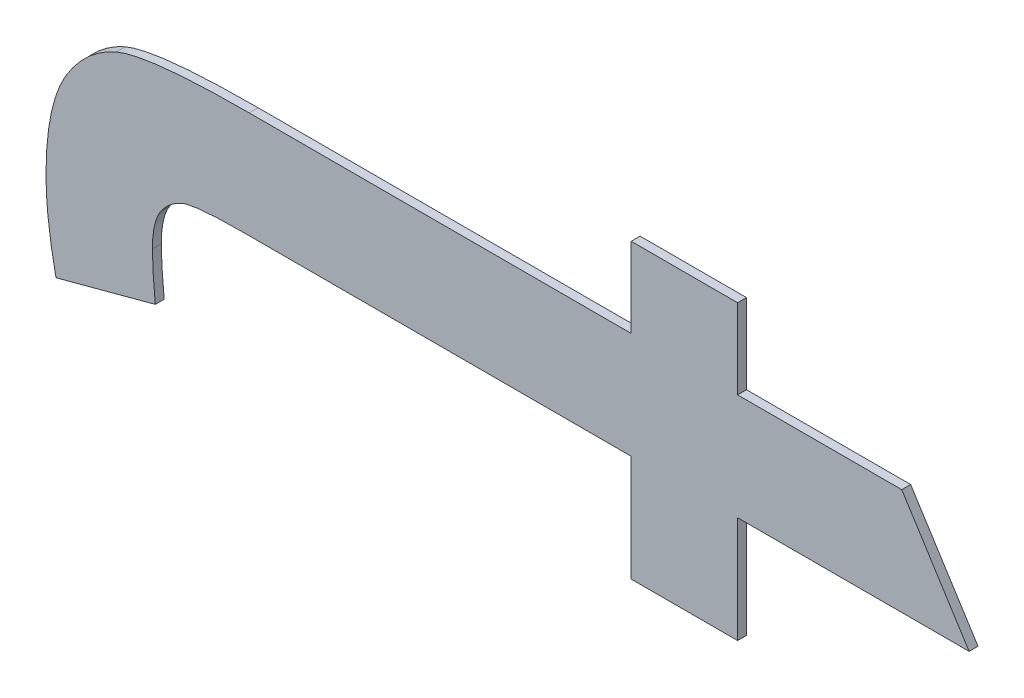
ISO-10303-21;
HEADER;
FILE_DESCRIPTION(('STEP AP214'),'2;1');
FILE_NAME('part.step','',(''),(''),'','','');
FILE_SCHEMA(('AUTOMOTIVE_DESIGN { 1 0 10303 214 1 1 1 1 }'));
ENDSEC;
DATA;
#1=APPLICATION_CONTEXT('core data for automotive mechanical design processes');
#2=APPLICATION_PROTOCOL_DEFINITION('international standard','automotive_design',2000,#1);
#3=PRODUCT_CONTEXT('',#1,'mechanical');
#4=PRODUCT('Part','Part','',(#3));
#5=PRODUCT_RELATED_PRODUCT_CATEGORY('part','',(#4));
#6=PRODUCT_DEFINITION_FORMATION('','',#4);
#7=PRODUCT_DEFINITION_CONTEXT('part definition',#1,'design');
#8=PRODUCT_DEFINITION('design','',#6,#7);
#9=PRODUCT_DEFINITION_SHAPE('','',#8);
#10=(LENGTH_UNIT() NAMED_UNIT(*) SI_UNIT(.MILLI.,.METRE.));
#11=(NAMED_UNIT(*) PLANE_ANGLE_UNIT() SI_UNIT($,.RADIAN.));
#12=(NAMED_UNIT(*) SI_UNIT($,.STERADIAN.) SOLID_ANGLE_UNIT());
#13=UNCERTAINTY_MEASURE_WITH_UNIT(LENGTH_MEASURE(1.E-05),#10,'distance_accuracy_value','');
#14=(GEOMETRIC_REPRESENTATION_CONTEXT(3) GLOBAL_UNCERTAINTY_ASSIGNED_CONTEXT((#13)) GLOBAL_UNIT_ASSIGNED_CONTEXT((#10,
#11,#12)) REPRESENTATION_CONTEXT('',''));
#15=CARTESIAN_POINT('',(0.,0.,0.));
#16=DIRECTION('',(0.,0.,1.));
#17=DIRECTION('',(1.,0.,0.));
#18=AXIS2_PLACEMENT_3D('',#15,#16,#17);
#19=CARTESIAN_POINT('',(1.0877452835503,1.3267694172606,1.7496000059366));
#20=DIRECTION('',(0.258668742971966,-0.965966087090692,0.));
#21=DIRECTION('',(0.,0.,-1.));
#22=AXIS2_PLACEMENT_3D('',#19,#20,#21);
#23=PLANE('',#22);
#24=DIRECTION('',(0.,0.,1.));
#25=VECTOR('',#24,1.);
#26=CARTESIAN_POINT('',(1.0899779799409,1.3273672941183,1.7492000059366));
#27=LINE('',#26,#25);
#28=CARTESIAN_POINT('',(1.0899779799409,1.3273672941183,1.7492000059366));
#29=VERTEX_POINT('',#28);
#30=CARTESIAN_POINT('',(1.0899779799409,1.3273672941183,1.7496000059366));
#31=VERTEX_POINT('',#30);
#32=EDGE_CURVE('E11',#29,#31,#27,.T.);
#33=ORIENTED_EDGE('',*,*,#32,.T.);
#34=DIRECTION('',(-0.965966087090692,-0.258668742971966,0.));
#35=VECTOR('',#34,1.);
#36=CARTESIAN_POINT('',(1.0899779799409,1.3273672941183,1.7496000059366));
#37=LINE('',#36,#35);
#38=CARTESIAN_POINT('',(1.0855125871597,1.3261715404029,1.7496000059366));
#39=VERTEX_POINT('',#38);
#40=EDGE_CURVE('E24',#31,#39,#37,.T.);
#41=ORIENTED_EDGE('',*,*,#40,.T.);
#42=DIRECTION('',(0.,0.,1.));
#43=VECTOR('',#42,1.);
#44=CARTESIAN_POINT('',(1.0855125871597,1.3261715404029,1.7492000059366));
#45=LINE('',#44,#43);
#46=CARTESIAN_POINT('',(1.0855125871597,1.3261715404029,1.7492000059366));
#47=VERTEX_POINT('',#46);
#48=EDGE_CURVE('E389',#47,#39,#45,.T.);
#49=ORIENTED_EDGE('',*,*,#48,.F.);
#50=DIRECTION('',(-0.965966087090692,-0.258668742971966,0.));
#51=VECTOR('',#50,1.);
#52=CARTESIAN_POINT('',(1.0899779799409,1.3273672941183,1.7492000059366));
#53=LINE('',#52,#51);
#54=EDGE_CURVE('E384',#29,#47,#53,.T.);
#55=ORIENTED_EDGE('',*,*,#54,.F.);
#56=EDGE_LOOP('',(#33,#41,#49,#55));
#57=FACE_BOUND('',#56,.T.);
#58=ADVANCED_FACE('F17',(#57),#23,.T.);
#59=CARTESIAN_POINT('',(1.0855125871597,1.3261715404029,1.7496000059366));
#60=CARTESIAN_POINT('',(1.0855125871597,1.3261715404029,1.7491200059366));
#61=CARTESIAN_POINT('',(1.0850641795163,1.3282827930567,1.7496000059366));
#62=CARTESIAN_POINT('',(1.0850641795163,1.3282827930567,1.7491200059366));
#63=CARTESIAN_POINT('',(1.0850641795163,1.3299643217191,1.7496000059366));
#64=CARTESIAN_POINT('',(1.0850641795163,1.3299643217191,1.7491200059366));
#65=B_SPLINE_SURFACE_WITH_KNOTS('',2,1,((#59,#60),(#61,#62),(#63,#64)),.UNSPECIFIED.,.F.,.F.,
.F.,(3,3),(2,2),(0.,1.),(0.,0.000239999999999974),.UNSPECIFIED.);
#66=CARTESIAN_POINT('',(1.0855125871597,1.3261715404029,1.7496000059366));
#67=CARTESIAN_POINT('',(1.0850641795163,1.3282827930567,1.7496000059366));
#68=CARTESIAN_POINT('',(1.0850641795163,1.3299643217191,1.7496000059366));
#69=B_SPLINE_CURVE_WITH_KNOTS('',2,(#66,#67,#68),.UNSPECIFIED.,.F.,.F.,(3,3),(0.,1.),.UNSPECIFIED.);
#70=CARTESIAN_POINT('',(1.0850641795163,1.3299643217191,1.7496000059366));
#71=VERTEX_POINT('',#70);
#72=EDGE_CURVE('E380',#39,#71,#69,.T.);
#73=DIRECTION('',(0.,0.,1.));
#74=VECTOR('',#73,1.);
#75=CARTESIAN_POINT('',(1.0850641795163,1.3299643217191,1.7492000059366));
#76=LINE('',#75,#74);
#77=CARTESIAN_POINT('',(1.0850641795163,1.3299643217191,1.7492000059366));
#78=VERTEX_POINT('',#77);
#79=EDGE_CURVE('E374',#78,#71,#76,.T.);
#80=CARTESIAN_POINT('',(1.0855125871597,1.3261715404029,1.7492000059366));
#81=CARTESIAN_POINT('',(1.0850641795163,1.3282827930567,1.7492000059366));
#82=CARTESIAN_POINT('',(1.0850641795163,1.3299643217191,1.7492000059366));
#83=B_SPLINE_CURVE_WITH_KNOTS('',2,(#80,#81,#82),.UNSPECIFIED.,.F.,.F.,(3,3),(0.,1.),.UNSPECIFIED.);
#84=EDGE_CURVE('E366',#47,#78,#83,.T.);
#85=ORIENTED_EDGE('',*,*,#48,.T.);
#86=ORIENTED_EDGE('',*,*,#72,.T.);
#87=ORIENTED_EDGE('',*,*,#79,.F.);
#88=ORIENTED_EDGE('',*,*,#84,.F.);
#89=EDGE_LOOP('',(#85,#86,#87,#88));
#90=FACE_BOUND('',#89,.T.);
#91=ADVANCED_FACE('F395',(#90),#65,.T.);
#92=CARTESIAN_POINT('',(1.0850641795163,1.3299643217191,1.7496000059366));
#93=CARTESIAN_POINT('',(1.0850641795163,1.3299643217191,1.7491200059366));
#94=CARTESIAN_POINT('',(1.0850641795163,1.3326921348827,1.7496000059366));
#95=CARTESIAN_POINT('',(1.0850641795163,1.3326921348827,1.7491200059366));
#96=CARTESIAN_POINT('',(1.0859236274993,1.3342055106789,1.7496000059366));
#97=CARTESIAN_POINT('',(1.0859236274993,1.3342055106789,1.7491200059366));
#98=B_SPLINE_SURFACE_WITH_KNOTS('',2,1,((#92,#93),(#94,#95),(#96,#97)),.UNSPECIFIED.,.F.,.F.,
.F.,(3,3),(2,2),(0.,1.),(0.,0.000239999999999974),.UNSPECIFIED.);
#99=CARTESIAN_POINT('',(1.0850641795163,1.3299643217191,1.7496000059366));
#100=CARTESIAN_POINT('',(1.0850641795163,1.3326921348827,1.7496000059366));
#101=CARTESIAN_POINT('',(1.0859236274993,1.3342055106789,1.7496000059366));
#102=B_SPLINE_CURVE_WITH_KNOTS('',2,(#99,#100,#101),.UNSPECIFIED.,.F.,.F.,(3,3),(0.,1.),.UNSPECIFIED.);
#103=CARTESIAN_POINT('',(1.0859236274993,1.3342055106789,1.7496000059366));
#104=VERTEX_POINT('',#103);
#105=EDGE_CURVE('E362',#71,#104,#102,.T.);
#106=DIRECTION('',(0.,0.,1.));
#107=VECTOR('',#106,1.);
#108=CARTESIAN_POINT('',(1.0859236274993,1.3342055106789,1.7492000059366));
#109=LINE('',#108,#107);
#110=CARTESIAN_POINT('',(1.0859236274993,1.3342055106789,1.7492000059366));
#111=VERTEX_POINT('',#110);
#112=EDGE_CURVE('E356',#111,#104,#109,.T.);
#113=CARTESIAN_POINT('',(1.0850641795163,1.3299643217191,1.7492000059366));
#114=CARTESIAN_POINT('',(1.0850641795163,1.3326921348827,1.7492000059366));
#115=CARTESIAN_POINT('',(1.0859236274993,1.3342055106789,1.7492000059366));
#116=B_SPLINE_CURVE_WITH_KNOTS('',2,(#113,#114,#115),.UNSPECIFIED.,.F.,.F.,(3,3),(0.,1.),.UNSPECIFIED.);
#117=EDGE_CURVE('E348',#78,#111,#116,.T.);
#118=ORIENTED_EDGE('',*,*,#79,.T.);
#119=ORIENTED_EDGE('',*,*,#105,.T.);
#120=ORIENTED_EDGE('',*,*,#112,.F.);
#121=ORIENTED_EDGE('',*,*,#117,.F.);
#122=EDGE_LOOP('',(#118,#119,#120,#121));
#123=FACE_BOUND('',#122,.T.);
#124=ADVANCED_FACE('F401',(#123),#98,.T.);
#125=CARTESIAN_POINT('',(1.0859236274993,1.3342055106789,1.7496000059366));
#126=CARTESIAN_POINT('',(1.0859236274993,1.3342055106789,1.7491200059366));
#127=CARTESIAN_POINT('',(1.0868017591341,1.3357002028233,1.7496000059366));
#128=CARTESIAN_POINT('',(1.0868017591341,1.3357002028233,1.7491200059366));
#129=CARTESIAN_POINT('',(1.0882217166713,1.3363167633327,1.7496000059366));
#130=CARTESIAN_POINT('',(1.0882217166713,1.3363167633327,1.7491200059366));
#131=B_SPLINE_SURFACE_WITH_KNOTS('',2,1,((#125,#126),(#127,#128),(#129,#130)),.UNSPECIFIED.,.F.,
.F.,.F.,(3,3),(2,2),(0.,1.),(0.,0.000239999999999974),.UNSPECIFIED.);
#132=CARTESIAN_POINT('',(1.0859236274993,1.3342055106789,1.7496000059366));
#133=CARTESIAN_POINT('',(1.0868017591341,1.3357002028233,1.7496000059366));
#134=CARTESIAN_POINT('',(1.0882217166713,1.3363167633327,1.7496000059366));
#135=B_SPLINE_CURVE_WITH_KNOTS('',2,(#132,#133,#134),.UNSPECIFIED.,.F.,.F.,(3,3),(0.,1.),.UNSPECIFIED.);
#136=CARTESIAN_POINT('',(1.0882217166713,1.3363167633327,1.7496000059366));
#137=VERTEX_POINT('',#136);
#138=EDGE_CURVE('E344',#104,#137,#135,.T.);
#139=DIRECTION('',(0.,0.,1.));
#140=VECTOR('',#139,1.);
#141=CARTESIAN_POINT('',(1.0882217166713,1.3363167633327,1.7492000059366));
#142=LINE('',#141,#140);
#143=CARTESIAN_POINT('',(1.0882217166713,1.3363167633327,1.7492000059366));
#144=VERTEX_POINT('',#143);
#145=EDGE_CURVE('E338',#144,#137,#142,.T.);
#146=CARTESIAN_POINT('',(1.0859236274993,1.3342055106789,1.7492000059366));
#147=CARTESIAN_POINT('',(1.0868017591341,1.3357002028233,1.7492000059366));
#148=CARTESIAN_POINT('',(1.0882217166713,1.3363167633327,1.7492000059366));
#149=B_SPLINE_CURVE_WITH_KNOTS('',2,(#146,#147,#148),.UNSPECIFIED.,.F.,.F.,(3,3),(0.,1.),.UNSPECIFIED.);
#150=EDGE_CURVE('E330',#111,#144,#149,.T.);
#151=ORIENTED_EDGE('',*,*,#112,.T.);
#152=ORIENTED_EDGE('',*,*,#138,.T.);
#153=ORIENTED_EDGE('',*,*,#145,.F.);
#154=ORIENTED_EDGE('',*,*,#150,.F.);
#155=EDGE_LOOP('',(#151,#152,#153,#154));
#156=FACE_BOUND('',#155,.T.);
#157=ADVANCED_FACE('F405',(#156),#131,.T.);
#158=CARTESIAN_POINT('',(1.0882217166713,1.3363167633327,1.7496000059366));
#159=CARTESIAN_POINT('',(1.0882217166713,1.3363167633327,1.7491200059366));
#160=CARTESIAN_POINT('',(1.0896416742085,1.3369333238423,1.7496000059366));
#161=CARTESIAN_POINT('',(1.0896416742085,1.3369333238423,1.7491200059366));
#162=CARTESIAN_POINT('',(1.0942004852487,1.3369333238423,1.7496000059366));
#163=CARTESIAN_POINT('',(1.0942004852487,1.3369333238423,1.7491200059366));
#164=B_SPLINE_SURFACE_WITH_KNOTS('',2,1,((#158,#159),(#160,#161),(#162,#163)),.UNSPECIFIED.,.F.,
.F.,.F.,(3,3),(2,2),(0.,1.),(0.,0.000239999999999974),.UNSPECIFIED.);
#165=CARTESIAN_POINT('',(1.0882217166713,1.3363167633327,1.7496000059366));
#166=CARTESIAN_POINT('',(1.0896416742085,1.3369333238423,1.7496000059366));
#167=CARTESIAN_POINT('',(1.0942004852487,1.3369333238423,1.7496000059366));
#168=B_SPLINE_CURVE_WITH_KNOTS('',2,(#165,#166,#167),.UNSPECIFIED.,.F.,.F.,(3,3),(0.,1.),.UNSPECIFIED.);
#169=CARTESIAN_POINT('',(1.0942004852487,1.3369333238423,1.7496000059366));
#170=VERTEX_POINT('',#169);
#171=EDGE_CURVE('E326',#137,#170,#168,.T.);
#172=DIRECTION('',(0.,0.,1.));
#173=VECTOR('',#172,1.);
#174=CARTESIAN_POINT('',(1.0942004852487,1.3369333238423,1.7492000059366));
#175=LINE('',#174,#173);
#176=CARTESIAN_POINT('',(1.0942004852487,1.3369333238423,1.7492000059366));
#177=VERTEX_POINT('',#176);
#178=EDGE_CURVE('E320',#177,#170,#175,.T.);
#179=CARTESIAN_POINT('',(1.0882217166713,1.3363167633327,1.7492000059366));
#180=CARTESIAN_POINT('',(1.0896416742085,1.3369333238423,1.7492000059366));
#181=CARTESIAN_POINT('',(1.0942004852487,1.3369333238423,1.7492000059366));
#182=B_SPLINE_CURVE_WITH_KNOTS('',2,(#179,#180,#181),.UNSPECIFIED.,.F.,.F.,(3,3),(0.,1.),.UNSPECIFIED.);
#183=EDGE_CURVE('E315',#144,#177,#182,.T.);
#184=ORIENTED_EDGE('',*,*,#145,.T.);
#185=ORIENTED_EDGE('',*,*,#171,.T.);
#186=ORIENTED_EDGE('',*,*,#178,.F.);
#187=ORIENTED_EDGE('',*,*,#183,.F.);
#188=EDGE_LOOP('',(#184,#185,#186,#187));
#189=FACE_BOUND('',#188,.T.);
#190=ADVANCED_FACE('F409',(#189),#164,.T.);
#191=CARTESIAN_POINT('',(1.102785623253,1.3369333238423,1.7496000059366));
#192=DIRECTION('',(0.,1.,0.));
#193=DIRECTION('',(0.,0.,1.));
#194=AXIS2_PLACEMENT_3D('',#191,#192,#193);
#195=PLANE('',#194);
#196=ORIENTED_EDGE('',*,*,#178,.T.);
#197=DIRECTION('',(1.,0.,0.));
#198=VECTOR('',#197,1.);
#199=CARTESIAN_POINT('',(1.0942004852487,1.3369333238423,1.7496000059366));
#200=LINE('',#199,#198);
#201=CARTESIAN_POINT('',(1.1113707612573,1.3369333238423,1.7496000059366));
#202=VERTEX_POINT('',#201);
#203=EDGE_CURVE('E313',#170,#202,#200,.T.);
#204=ORIENTED_EDGE('',*,*,#203,.T.);
#205=DIRECTION('',(0.,0.,1.));
#206=VECTOR('',#205,1.);
#207=CARTESIAN_POINT('',(1.1113707612573,1.3369333238423,1.7492000059366));
#208=LINE('',#207,#206);
#209=CARTESIAN_POINT('',(1.1113707612573,1.3369333238423,1.7492000059366));
#210=VERTEX_POINT('',#209);
#211=EDGE_CURVE('E310',#210,#202,#208,.T.);
#212=ORIENTED_EDGE('',*,*,#211,.F.);
#213=DIRECTION('',(1.,0.,0.));
#214=VECTOR('',#213,1.);
#215=CARTESIAN_POINT('',(1.0942004852487,1.3369333238423,1.7492000059366));
#216=LINE('',#215,#214);
#217=EDGE_CURVE('E307',#177,#210,#216,.T.);
#218=ORIENTED_EDGE('',*,*,#217,.F.);
#219=EDGE_LOOP('',(#196,#204,#212,#218));
#220=FACE_BOUND('',#219,.T.);
#221=ADVANCED_FACE('F412',(#220),#195,.T.);
#222=CARTESIAN_POINT('',(1.1113707612573,1.3387269544156,1.7496000059366));
#223=DIRECTION('',(-1.,0.,0.));
#224=DIRECTION('',(0.,0.,1.));
#225=AXIS2_PLACEMENT_3D('',#222,#223,#224);
#226=PLANE('',#225);
#227=ORIENTED_EDGE('',*,*,#211,.T.);
#228=DIRECTION('',(0.,1.,0.));
#229=VECTOR('',#228,1.);
#230=CARTESIAN_POINT('',(1.1113707612573,1.3369333238423,1.7496000059366));
#231=LINE('',#230,#229);
#232=CARTESIAN_POINT('',(1.1113707612573,1.3405205849889,1.7496000059366));
#233=VERTEX_POINT('',#232);
#234=EDGE_CURVE('E305',#202,#233,#231,.T.);
#235=ORIENTED_EDGE('',*,*,#234,.T.);
#236=DIRECTION('',(0.,0.,1.));
#237=VECTOR('',#236,1.);
#238=CARTESIAN_POINT('',(1.1113707612573,1.3405205849889,1.7492000059366));
#239=LINE('',#238,#237);
#240=CARTESIAN_POINT('',(1.1113707612573,1.3405205849889,1.7492000059366));
#241=VERTEX_POINT('',#240);
#242=EDGE_CURVE('E302',#241,#233,#239,.T.);
#243=ORIENTED_EDGE('',*,*,#242,.F.);
#244=DIRECTION('',(0.,1.,0.));
#245=VECTOR('',#244,1.);
#246=CARTESIAN_POINT('',(1.1113707612573,1.3369333238423,1.7492000059366));
#247=LINE('',#246,#245);
#248=EDGE_CURVE('E299',#210,#241,#247,.T.);
#249=ORIENTED_EDGE('',*,*,#248,.F.);
#250=EDGE_LOOP('',(#227,#235,#243,#249));
#251=FACE_BOUND('',#250,.T.);
#252=ADVANCED_FACE('F417',(#251),#226,.T.);
#253=CARTESIAN_POINT('',(1.1137622686883,1.3405205849889,1.7496000059366));
#254=DIRECTION('',(0.,1.,0.));
#255=DIRECTION('',(0.,0.,1.));
#256=AXIS2_PLACEMENT_3D('',#253,#254,#255);
#257=PLANE('',#256);
#258=ORIENTED_EDGE('',*,*,#242,.T.);
#259=DIRECTION('',(1.,0.,0.));
#260=VECTOR('',#259,1.);
#261=CARTESIAN_POINT('',(1.1113707612573,1.3405205849889,1.7496000059366));
#262=LINE('',#261,#260);
#263=CARTESIAN_POINT('',(1.1161537761193,1.3405205849889,1.7496000059366));
#264=VERTEX_POINT('',#263);
#265=EDGE_CURVE('E297',#233,#264,#262,.T.);
#266=ORIENTED_EDGE('',*,*,#265,.T.);
#267=DIRECTION('',(0.,0.,1.));
#268=VECTOR('',#267,1.);
#269=CARTESIAN_POINT('',(1.1161537761193,1.3405205849889,1.7492000059366));
#270=LINE('',#269,#268);
#271=CARTESIAN_POINT('',(1.1161537761193,1.3405205849889,1.7492000059366));
#272=VERTEX_POINT('',#271);
#273=EDGE_CURVE('E294',#272,#264,#270,.T.);
#274=ORIENTED_EDGE('',*,*,#273,.F.);
#275=DIRECTION('',(1.,0.,0.));
#276=VECTOR('',#275,1.);
#277=CARTESIAN_POINT('',(1.1113707612573,1.3405205849889,1.7492000059366));
#278=LINE('',#277,#276);
#279=EDGE_CURVE('E291',#241,#272,#278,.T.);
#280=ORIENTED_EDGE('',*,*,#279,.F.);
#281=EDGE_LOOP('',(#258,#266,#274,#280));
#282=FACE_BOUND('',#281,.T.);
#283=ADVANCED_FACE('F421',(#282),#257,.T.);
#284=CARTESIAN_POINT('',(1.1161537761193,1.3387269544156,1.7496000059366));
#285=DIRECTION('',(1.,0.,0.));
#286=DIRECTION('',(0.,0.,-1.));
#287=AXIS2_PLACEMENT_3D('',#284,#285,#286);
#288=PLANE('',#287);
#289=ORIENTED_EDGE('',*,*,#273,.T.);
#290=DIRECTION('',(0.,-1.,0.));
#291=VECTOR('',#290,1.);
#292=CARTESIAN_POINT('',(1.1161537761193,1.3405205849889,1.7496000059366));
#293=LINE('',#292,#291);
#294=CARTESIAN_POINT('',(1.1161537761193,1.3369333238423,1.7496000059366));
#295=VERTEX_POINT('',#294);
#296=EDGE_CURVE('E289',#264,#295,#293,.T.);
#297=ORIENTED_EDGE('',*,*,#296,.T.);
#298=DIRECTION('',(0.,0.,1.));
#299=VECTOR('',#298,1.);
#300=CARTESIAN_POINT('',(1.1161537761193,1.3369333238423,1.7492000059366));
#301=LINE('',#300,#299);
#302=CARTESIAN_POINT('',(1.1161537761193,1.3369333238423,1.7492000059366));
#303=VERTEX_POINT('',#302);
#304=EDGE_CURVE('E286',#303,#295,#301,.T.);
#305=ORIENTED_EDGE('',*,*,#304,.F.);
#306=DIRECTION('',(0.,-1.,0.));
#307=VECTOR('',#306,1.);
#308=CARTESIAN_POINT('',(1.1161537761193,1.3405205849889,1.7492000059366));
#309=LINE('',#308,#307);
#310=EDGE_CURVE('E283',#272,#303,#309,.T.);
#311=ORIENTED_EDGE('',*,*,#310,.F.);
#312=EDGE_LOOP('',(#289,#297,#305,#311));
#313=FACE_BOUND('',#312,.T.);
#314=ADVANCED_FACE('F425',(#313),#288,.T.);
#315=CARTESIAN_POINT('',(1.1198437973507,1.3369333238423,1.7496000059366));
#316=DIRECTION('',(0.,1.,0.));
#317=DIRECTION('',(0.,0.,1.));
#318=AXIS2_PLACEMENT_3D('',#315,#316,#317);
#319=PLANE('',#318);
#320=ORIENTED_EDGE('',*,*,#304,.T.);
#321=DIRECTION('',(1.,0.,0.));
#322=VECTOR('',#321,1.);
#323=CARTESIAN_POINT('',(1.1161537761193,1.3369333238423,1.7496000059366));
#324=LINE('',#323,#322);
#325=CARTESIAN_POINT('',(1.1235338185821,1.3369333238423,1.7496000059366));
#326=VERTEX_POINT('',#325);
#327=EDGE_CURVE('E281',#295,#326,#324,.T.);
#328=ORIENTED_EDGE('',*,*,#327,.T.);
#329=DIRECTION('',(0.,0.,1.));
#330=VECTOR('',#329,1.);
#331=CARTESIAN_POINT('',(1.1235338185821,1.3369333238423,1.7492000059366));
#332=LINE('',#331,#330);
#333=CARTESIAN_POINT('',(1.1235338185821,1.3369333238423,1.7492000059366));
#334=VERTEX_POINT('',#333);
#335=EDGE_CURVE('E278',#334,#326,#332,.T.);
#336=ORIENTED_EDGE('',*,*,#335,.F.);
#337=DIRECTION('',(1.,0.,0.));
#338=VECTOR('',#337,1.);
#339=CARTESIAN_POINT('',(1.1161537761193,1.3369333238423,1.7492000059366));
#340=LINE('',#339,#338);
#341=EDGE_CURVE('E275',#303,#334,#340,.T.);
#342=ORIENTED_EDGE('',*,*,#341,.F.);
#343=EDGE_LOOP('',(#320,#328,#336,#342));
#344=FACE_BOUND('',#343,.T.);
#345=ADVANCED_FACE('F428',(#344),#319,.T.);
#346=CARTESIAN_POINT('',(1.1250471943783,1.3345418164113,1.7496000059366));
#347=DIRECTION('',(0.845017958237531,0.534737926704357,0.));
#348=DIRECTION('',(0.,0.,-1.));
#349=AXIS2_PLACEMENT_3D('',#346,#347,#348);
#350=PLANE('',#349);
#351=ORIENTED_EDGE('',*,*,#335,.T.);
#352=DIRECTION('',(0.534737926704357,-0.845017958237531,0.));
#353=VECTOR('',#352,1.);
#354=CARTESIAN_POINT('',(1.1235338185821,1.3369333238423,1.7496000059366));
#355=LINE('',#354,#353);
#356=CARTESIAN_POINT('',(1.1265605701745,1.3321503089803,1.7496000059366));
#357=VERTEX_POINT('',#356);
#358=EDGE_CURVE('E273',#326,#357,#355,.T.);
#359=ORIENTED_EDGE('',*,*,#358,.T.);
#360=DIRECTION('',(0.,0.,1.));
#361=VECTOR('',#360,1.);
#362=CARTESIAN_POINT('',(1.1265605701745,1.3321503089803,1.7492000059366));
#363=LINE('',#362,#361);
#364=CARTESIAN_POINT('',(1.1265605701745,1.3321503089803,1.7492000059366));
#365=VERTEX_POINT('',#364);
#366=EDGE_CURVE('E270',#365,#357,#363,.T.);
#367=ORIENTED_EDGE('',*,*,#366,.F.);
#368=DIRECTION('',(0.534737926704357,-0.845017958237531,0.));
#369=VECTOR('',#368,1.);
#370=CARTESIAN_POINT('',(1.1235338185821,1.3369333238423,1.7492000059366));
#371=LINE('',#370,#369);
#372=EDGE_CURVE('E267',#334,#365,#371,.T.);
#373=ORIENTED_EDGE('',*,*,#372,.F.);
#374=EDGE_LOOP('',(#351,#359,#367,#373));
#375=FACE_BOUND('',#374,.T.);
#376=ADVANCED_FACE('F433',(#375),#350,.T.);
#377=CARTESIAN_POINT('',(1.1213571731469,1.3321503089803,1.7496000059366));
#378=DIRECTION('',(0.,-1.,0.));
#379=DIRECTION('',(0.,0.,-1.));
#380=AXIS2_PLACEMENT_3D('',#377,#378,#379);
#381=PLANE('',#380);
#382=ORIENTED_EDGE('',*,*,#366,.T.);
#383=DIRECTION('',(-1.,0.,0.));
#384=VECTOR('',#383,1.);
#385=CARTESIAN_POINT('',(1.1265605701745,1.3321503089803,1.7496000059366));
#386=LINE('',#385,#384);
#387=CARTESIAN_POINT('',(1.1161537761193,1.3321503089803,1.7496000059366));
#388=VERTEX_POINT('',#387);
#389=EDGE_CURVE('E265',#357,#388,#386,.T.);
#390=ORIENTED_EDGE('',*,*,#389,.T.);
#391=DIRECTION('',(0.,0.,1.));
#392=VECTOR('',#391,1.);
#393=CARTESIAN_POINT('',(1.1161537761193,1.3321503089803,1.7492000059366));
#394=LINE('',#393,#392);
#395=CARTESIAN_POINT('',(1.1161537761193,1.3321503089803,1.7492000059366));
#396=VERTEX_POINT('',#395);
#397=EDGE_CURVE('E262',#396,#388,#394,.T.);
#398=ORIENTED_EDGE('',*,*,#397,.F.);
#399=DIRECTION('',(-1.,0.,0.));
#400=VECTOR('',#399,1.);
#401=CARTESIAN_POINT('',(1.1265605701745,1.3321503089803,1.7492000059366));
#402=LINE('',#401,#400);
#403=EDGE_CURVE('E259',#365,#396,#402,.T.);
#404=ORIENTED_EDGE('',*,*,#403,.F.);
#405=EDGE_LOOP('',(#382,#390,#398,#404));
#406=FACE_BOUND('',#405,.T.);
#407=ADVANCED_FACE('F437',(#406),#381,.T.);
#408=CARTESIAN_POINT('',(1.1161537761193,1.3297588015493,1.7496000059366));
#409=DIRECTION('',(1.,0.,0.));
#410=DIRECTION('',(0.,0.,-1.));
#411=AXIS2_PLACEMENT_3D('',#408,#409,#410);
#412=PLANE('',#411);
#413=ORIENTED_EDGE('',*,*,#397,.T.);
#414=DIRECTION('',(0.,-1.,0.));
#415=VECTOR('',#414,1.);
#416=CARTESIAN_POINT('',(1.1161537761193,1.3321503089803,1.7496000059366));
#417=LINE('',#416,#415);
#418=CARTESIAN_POINT('',(1.1161537761193,1.3273672941183,1.7496000059366));
#419=VERTEX_POINT('',#418);
#420=EDGE_CURVE('E257',#388,#419,#417,.T.);
#421=ORIENTED_EDGE('',*,*,#420,.T.);
#422=DIRECTION('',(0.,0.,1.));
#423=VECTOR('',#422,1.);
#424=CARTESIAN_POINT('',(1.1161537761193,1.3273672941183,1.7492000059366));
#425=LINE('',#424,#423);
#426=CARTESIAN_POINT('',(1.1161537761193,1.3273672941183,1.7492000059366));
#427=VERTEX_POINT('',#426);
#428=EDGE_CURVE('E254',#427,#419,#425,.T.);
#429=ORIENTED_EDGE('',*,*,#428,.F.);
#430=DIRECTION('',(0.,-1.,0.));
#431=VECTOR('',#430,1.);
#432=CARTESIAN_POINT('',(1.1161537761193,1.3321503089803,1.7492000059366));
#433=LINE('',#432,#431);
#434=EDGE_CURVE('E251',#396,#427,#433,.T.);
#435=ORIENTED_EDGE('',*,*,#434,.F.);
#436=EDGE_LOOP('',(#413,#421,#429,#435));
#437=FACE_BOUND('',#436,.T.);
#438=ADVANCED_FACE('F441',(#437),#412,.T.);
#439=CARTESIAN_POINT('',(1.1137622686883,1.3273672941183,1.7496000059366));
#440=DIRECTION('',(0.,-1.,0.));
#441=DIRECTION('',(0.,0.,-1.));
#442=AXIS2_PLACEMENT_3D('',#439,#440,#441);
#443=PLANE('',#442);
#444=ORIENTED_EDGE('',*,*,#428,.T.);
#445=DIRECTION('',(-1.,0.,0.));
#446=VECTOR('',#445,1.);
#447=CARTESIAN_POINT('',(1.1161537761193,1.3273672941183,1.7496000059366));
#448=LINE('',#447,#446);
#449=CARTESIAN_POINT('',(1.1113707612573,1.3273672941183,1.7496000059366));
#450=VERTEX_POINT('',#449);
#451=EDGE_CURVE('E249',#419,#450,#448,.T.);
#452=ORIENTED_EDGE('',*,*,#451,.T.);
#453=DIRECTION('',(0.,0.,1.));
#454=VECTOR('',#453,1.);
#455=CARTESIAN_POINT('',(1.1113707612573,1.3273672941183,1.7492000059366));
#456=LINE('',#455,#454);
#457=CARTESIAN_POINT('',(1.1113707612573,1.3273672941183,1.7492000059366));
#458=VERTEX_POINT('',#457);
#459=EDGE_CURVE('E246',#458,#450,#456,.T.);
#460=ORIENTED_EDGE('',*,*,#459,.F.);
#461=DIRECTION('',(-1.,0.,0.));
#462=VECTOR('',#461,1.);
#463=CARTESIAN_POINT('',(1.1161537761193,1.3273672941183,1.7492000059366));
#464=LINE('',#463,#462);
#465=EDGE_CURVE('E243',#427,#458,#464,.T.);
#466=ORIENTED_EDGE('',*,*,#465,.F.);
#467=EDGE_LOOP('',(#444,#452,#460,#466));
#468=FACE_BOUND('',#467,.T.);
#469=ADVANCED_FACE('F444',(#468),#443,.T.);
#470=CARTESIAN_POINT('',(1.1113707612573,1.3297588015493,1.7496000059366));
#471=DIRECTION('',(-1.,0.,0.));
#472=DIRECTION('',(0.,0.,1.));
#473=AXIS2_PLACEMENT_3D('',#470,#471,#472);
#474=PLANE('',#473);
#475=ORIENTED_EDGE('',*,*,#459,.T.);
#476=DIRECTION('',(0.,1.,0.));
#477=VECTOR('',#476,1.);
#478=CARTESIAN_POINT('',(1.1113707612573,1.3273672941183,1.7496000059366));
#479=LINE('',#478,#477);
#480=CARTESIAN_POINT('',(1.1113707612573,1.3321503089803,1.7496000059366));
#481=VERTEX_POINT('',#480);
#482=EDGE_CURVE('E241',#450,#481,#479,.T.);
#483=ORIENTED_EDGE('',*,*,#482,.T.);
#484=DIRECTION('',(0.,0.,1.));
#485=VECTOR('',#484,1.);
#486=CARTESIAN_POINT('',(1.1113707612573,1.3321503089803,1.7492000059366));
#487=LINE('',#486,#485);
#488=CARTESIAN_POINT('',(1.1113707612573,1.3321503089803,1.7492000059366));
#489=VERTEX_POINT('',#488);
#490=EDGE_CURVE('E238',#489,#481,#487,.T.);
#491=ORIENTED_EDGE('',*,*,#490,.F.);
#492=DIRECTION('',(0.,1.,0.));
#493=VECTOR('',#492,1.);
#494=CARTESIAN_POINT('',(1.1113707612573,1.3273672941183,1.7492000059366));
#495=LINE('',#494,#493);
#496=EDGE_CURVE('E235',#458,#489,#495,.T.);
#497=ORIENTED_EDGE('',*,*,#496,.F.);
#498=EDGE_LOOP('',(#475,#483,#491,#497));
#499=FACE_BOUND('',#498,.T.);
#500=ADVANCED_FACE('F449',(#499),#474,.T.);
#501=CARTESIAN_POINT('',(1.1026735213422,1.3321503089803,1.7496000059366));
#502=DIRECTION('',(0.,-1.,0.));
#503=DIRECTION('',(0.,0.,-1.));
#504=AXIS2_PLACEMENT_3D('',#501,#502,#503);
#505=PLANE('',#504);
#506=ORIENTED_EDGE('',*,*,#490,.T.);
#507=DIRECTION('',(-1.,0.,0.));
#508=VECTOR('',#507,1.);
#509=CARTESIAN_POINT('',(1.1113707612573,1.3321503089803,1.7496000059366));
#510=LINE('',#509,#508);
#511=CARTESIAN_POINT('',(1.0939762814271,1.3321503089803,1.7496000059366));
#512=VERTEX_POINT('',#511);
#513=EDGE_CURVE('E233',#481,#512,#510,.T.);
#514=ORIENTED_EDGE('',*,*,#513,.T.);
#515=DIRECTION('',(0.,0.,1.));
#516=VECTOR('',#515,1.);
#517=CARTESIAN_POINT('',(1.0939762814271,1.3321503089803,1.7492000059366));
#518=LINE('',#517,#516);
#519=CARTESIAN_POINT('',(1.0939762814271,1.3321503089803,1.7492000059366));
#520=VERTEX_POINT('',#519);
#521=EDGE_CURVE('E230',#520,#512,#518,.T.);
#522=ORIENTED_EDGE('',*,*,#521,.F.);
#523=DIRECTION('',(-1.,0.,0.));
#524=VECTOR('',#523,1.);
#525=CARTESIAN_POINT('',(1.1113707612573,1.3321503089803,1.7492000059366));
#526=LINE('',#525,#524);
#527=EDGE_CURVE('E224',#489,#520,#526,.T.);
#528=ORIENTED_EDGE('',*,*,#527,.F.);
#529=EDGE_LOOP('',(#506,#514,#522,#528));
#530=FACE_BOUND('',#529,.T.);
#531=ADVANCED_FACE('F453',(#530),#505,.T.);
#532=CARTESIAN_POINT('',(1.0939762814271,1.3321503089803,1.7496000059366));
#533=CARTESIAN_POINT('',(1.0939762814271,1.3321503089803,1.7491200059366));
#534=CARTESIAN_POINT('',(1.0918089778177,1.3321503089803,1.7496000059366));
#535=CARTESIAN_POINT('',(1.0918089778177,1.3321503089803,1.7491200059366));
#536=CARTESIAN_POINT('',(1.0911924173083,1.3319074215069,1.7496000059366));
#537=CARTESIAN_POINT('',(1.0911924173083,1.3319074215069,1.7491200059366));
#538=B_SPLINE_SURFACE_WITH_KNOTS('',2,1,((#532,#533),(#534,#535),(#536,#537)),.UNSPECIFIED.,.F.,
.F.,.F.,(3,3),(2,2),(0.,1.),(0.,0.000239999999999974),.UNSPECIFIED.);
#539=CARTESIAN_POINT('',(1.0939762814271,1.3321503089803,1.7496000059366));
#540=CARTESIAN_POINT('',(1.0918089778177,1.3321503089803,1.7496000059366));
#541=CARTESIAN_POINT('',(1.0911924173083,1.3319074215069,1.7496000059366));
#542=B_SPLINE_CURVE_WITH_KNOTS('',2,(#539,#540,#541),.UNSPECIFIED.,.F.,.F.,(3,3),(0.,1.),.UNSPECIFIED.);
#543=CARTESIAN_POINT('',(1.0911924173083,1.3319074215069,1.7496000059366));
#544=VERTEX_POINT('',#543);
#545=EDGE_CURVE('E220',#512,#544,#542,.T.);
#546=DIRECTION('',(0.,0.,1.));
#547=VECTOR('',#546,1.);
#548=CARTESIAN_POINT('',(1.0911924173083,1.3319074215069,1.7492000059366));
#549=LINE('',#548,#547);
#550=CARTESIAN_POINT('',(1.0911924173083,1.3319074215069,1.7492000059366));
#551=VERTEX_POINT('',#550);
#552=EDGE_CURVE('E214',#551,#544,#549,.T.);
#553=CARTESIAN_POINT('',(1.0939762814271,1.3321503089803,1.7492000059366));
#554=CARTESIAN_POINT('',(1.0918089778177,1.3321503089803,1.7492000059366));
#555=CARTESIAN_POINT('',(1.0911924173083,1.3319074215069,1.7492000059366));
#556=B_SPLINE_CURVE_WITH_KNOTS('',2,(#553,#554,#555),.UNSPECIFIED.,.F.,.F.,(3,3),(0.,1.),.UNSPECIFIED.);
#557=EDGE_CURVE('E207',#520,#551,#556,.T.);
#558=ORIENTED_EDGE('',*,*,#521,.T.);
#559=ORIENTED_EDGE('',*,*,#545,.T.);
#560=ORIENTED_EDGE('',*,*,#552,.F.);
#561=ORIENTED_EDGE('',*,*,#557,.F.);
#562=EDGE_LOOP('',(#558,#559,#560,#561));
#563=FACE_BOUND('',#562,.T.);
#564=ADVANCED_FACE('F456',(#563),#538,.T.);
#565=CARTESIAN_POINT('',(1.0911924173083,1.3319074215069,1.7496000059366));
#566=CARTESIAN_POINT('',(1.0911924173083,1.3319074215069,1.7491200059366));
#567=CARTESIAN_POINT('',(1.0905758567987,1.3316458503815,1.7496000059366));
#568=CARTESIAN_POINT('',(1.0905758567987,1.3316458503815,1.7491200059366));
#569=CARTESIAN_POINT('',(1.0902021837625,1.3310853408275,1.7496000059366));
#570=CARTESIAN_POINT('',(1.0902021837625,1.3310853408275,1.7491200059366));
#571=B_SPLINE_SURFACE_WITH_KNOTS('',2,1,((#565,#566),(#567,#568),(#569,#570)),.UNSPECIFIED.,.F.,
.F.,.F.,(3,3),(2,2),(0.,1.),(0.,0.000239999999999974),.UNSPECIFIED.);
#572=CARTESIAN_POINT('',(1.0911924173083,1.3319074215069,1.7496000059366));
#573=CARTESIAN_POINT('',(1.0905758567987,1.3316458503815,1.7496000059366));
#574=CARTESIAN_POINT('',(1.0902021837625,1.3310853408275,1.7496000059366));
#575=B_SPLINE_CURVE_WITH_KNOTS('',2,(#572,#573,#574),.UNSPECIFIED.,.F.,.F.,(3,3),(0.,1.),.UNSPECIFIED.);
#576=CARTESIAN_POINT('',(1.0902021837625,1.3310853408275,1.7496000059366));
#577=VERTEX_POINT('',#576);
#578=EDGE_CURVE('E203',#544,#577,#575,.T.);
#579=DIRECTION('',(0.,0.,1.));
#580=VECTOR('',#579,1.);
#581=CARTESIAN_POINT('',(1.0902021837625,1.3310853408275,1.7492000059366));
#582=LINE('',#581,#580);
#583=CARTESIAN_POINT('',(1.0902021837625,1.3310853408275,1.7492000059366));
#584=VERTEX_POINT('',#583);
#585=EDGE_CURVE('E198',#584,#577,#582,.T.);
#586=CARTESIAN_POINT('',(1.0911924173083,1.3319074215069,1.7492000059366));
#587=CARTESIAN_POINT('',(1.0905758567987,1.3316458503815,1.7492000059366));
#588=CARTESIAN_POINT('',(1.0902021837625,1.3310853408275,1.7492000059366));
#589=B_SPLINE_CURVE_WITH_KNOTS('',2,(#586,#587,#588),.UNSPECIFIED.,.F.,.F.,(3,3),(0.,1.),.UNSPECIFIED.);
#590=EDGE_CURVE('E167',#551,#584,#589,.T.);
#591=ORIENTED_EDGE('',*,*,#552,.T.);
#592=ORIENTED_EDGE('',*,*,#578,.T.);
#593=ORIENTED_EDGE('',*,*,#585,.F.);
#594=ORIENTED_EDGE('',*,*,#590,.F.);
#595=EDGE_LOOP('',(#591,#592,#593,#594));
#596=FACE_BOUND('',#595,.T.);
#597=ADVANCED_FACE('F459',(#596),#571,.T.);
#598=CARTESIAN_POINT('',(1.0902021837625,1.3310853408275,1.7496000059366));
#599=CARTESIAN_POINT('',(1.0902021837625,1.3310853408275,1.7491200059366));
#600=CARTESIAN_POINT('',(1.0898471943783,1.3305061476215,1.7496000059366));
#601=CARTESIAN_POINT('',(1.0898471943783,1.3305061476215,1.7491200059366));
#602=CARTESIAN_POINT('',(1.0898471943783,1.3294598631205,1.7496000059366));
#603=CARTESIAN_POINT('',(1.0898471943783,1.3294598631205,1.7491200059366));
#604=B_SPLINE_SURFACE_WITH_KNOTS('',2,1,((#598,#599),(#600,#601),(#602,#603)),.UNSPECIFIED.,.F.,
.F.,.F.,(3,3),(2,2),(0.,1.),(0.,0.000239999999999974),.UNSPECIFIED.);
#605=CARTESIAN_POINT('',(1.0902021837625,1.3310853408275,1.7496000059366));
#606=CARTESIAN_POINT('',(1.0898471943783,1.3305061476215,1.7496000059366));
#607=CARTESIAN_POINT('',(1.0898471943783,1.3294598631205,1.7496000059366));
#608=B_SPLINE_CURVE_WITH_KNOTS('',2,(#605,#606,#607),.UNSPECIFIED.,.F.,.F.,(3,3),(0.,1.),.UNSPECIFIED.);
#609=CARTESIAN_POINT('',(1.0898471943783,1.3294598631205,1.7496000059366));
#610=VERTEX_POINT('',#609);
#611=EDGE_CURVE('E156',#577,#610,#608,.T.);
#612=DIRECTION('',(0.,0.,1.));
#613=VECTOR('',#612,1.);
#614=CARTESIAN_POINT('',(1.0898471943783,1.3294598631205,1.7492000059366));
#615=LINE('',#614,#613);
#616=CARTESIAN_POINT('',(1.0898471943783,1.3294598631205,1.7492000059366));
#617=VERTEX_POINT('',#616);
#618=EDGE_CURVE('E150',#617,#610,#615,.T.);
#619=CARTESIAN_POINT('',(1.0902021837625,1.3310853408275,1.7492000059366));
#620=CARTESIAN_POINT('',(1.0898471943783,1.3305061476215,1.7492000059366));
#621=CARTESIAN_POINT('',(1.0898471943783,1.3294598631205,1.7492000059366));
#622=B_SPLINE_CURVE_WITH_KNOTS('',2,(#619,#620,#621),.UNSPECIFIED.,.F.,.F.,(3,3),(0.,1.),.UNSPECIFIED.);
#623=EDGE_CURVE('E154',#584,#617,#622,.T.);
#624=ORIENTED_EDGE('',*,*,#585,.T.);
#625=ORIENTED_EDGE('',*,*,#611,.T.);
#626=ORIENTED_EDGE('',*,*,#618,.F.);
#627=ORIENTED_EDGE('',*,*,#623,.F.);
#628=EDGE_LOOP('',(#624,#625,#626,#627));
#629=FACE_BOUND('',#628,.T.);
#630=ADVANCED_FACE('F153',(#629),#604,.T.);
#631=CARTESIAN_POINT('',(1.0898471943783,1.3294598631205,1.7496000059366));
#632=CARTESIAN_POINT('',(1.0898471943783,1.3294598631205,1.7491200059366));
#633=CARTESIAN_POINT('',(1.0898471943783,1.3286564660929,1.7496000059366));
#634=CARTESIAN_POINT('',(1.0898471943783,1.3286564660929,1.7491200059366));
#635=CARTESIAN_POINT('',(1.0899779799409,1.3273672941183,1.7496000059366));
#636=CARTESIAN_POINT('',(1.0899779799409,1.3273672941183,1.7491200059366));
#637=B_SPLINE_SURFACE_WITH_KNOTS('',2,1,((#631,#632),(#633,#634),(#635,#636)),.UNSPECIFIED.,.F.,
.F.,.F.,(3,3),(2,2),(0.,1.),(0.,0.000239999999999974),.UNSPECIFIED.);
#638=CARTESIAN_POINT('',(1.0898471943783,1.3294598631205,1.7496000059366));
#639=CARTESIAN_POINT('',(1.0898471943783,1.3286564660929,1.7496000059366));
#640=CARTESIAN_POINT('',(1.0899779799409,1.3273672941183,1.7496000059366));
#641=B_SPLINE_CURVE_WITH_KNOTS('',2,(#638,#639,#640),.UNSPECIFIED.,.F.,.F.,(3,3),(0.,1.),.UNSPECIFIED.);
#642=EDGE_CURVE('E168',#610,#31,#641,.T.);
#643=CARTESIAN_POINT('',(1.0898471943783,1.3294598631205,1.7492000059366));
#644=CARTESIAN_POINT('',(1.0898471943783,1.3286564660929,1.7492000059366));
#645=CARTESIAN_POINT('',(1.0899779799409,1.3273672941183,1.7492000059366));
#646=B_SPLINE_CURVE_WITH_KNOTS('',2,(#643,#644,#645),.UNSPECIFIED.,.F.,.F.,(3,3),(0.,1.),.UNSPECIFIED.);
#647=EDGE_CURVE('E164',#617,#29,#646,.T.);
#648=ORIENTED_EDGE('',*,*,#618,.T.);
#649=ORIENTED_EDGE('',*,*,#642,.T.);
#650=ORIENTED_EDGE('',*,*,#32,.F.);
#651=ORIENTED_EDGE('',*,*,#647,.F.);
#652=EDGE_LOOP('',(#648,#649,#650,#651));
#653=FACE_BOUND('',#652,.T.);
#654=ADVANCED_FACE('F170',(#653),#637,.T.);
#655=CARTESIAN_POINT('',(1.0850641795163,1.3333460626959,1.7492000059366));
#656=DIRECTION('',(0.,0.,-1.));
#657=DIRECTION('',(-1.,0.,0.));
#658=AXIS2_PLACEMENT_3D('',#655,#656,#657);
#659=PLANE('',#658);
#660=ORIENTED_EDGE('',*,*,#54,.T.);
#661=ORIENTED_EDGE('',*,*,#84,.T.);
#662=ORIENTED_EDGE('',*,*,#117,.T.);
#663=ORIENTED_EDGE('',*,*,#150,.T.);
#664=ORIENTED_EDGE('',*,*,#183,.T.);
#665=ORIENTED_EDGE('',*,*,#217,.T.);
#666=ORIENTED_EDGE('',*,*,#248,.T.);
#667=ORIENTED_EDGE('',*,*,#279,.T.);
#668=ORIENTED_EDGE('',*,*,#310,.T.);
#669=ORIENTED_EDGE('',*,*,#341,.T.);
#670=ORIENTED_EDGE('',*,*,#372,.T.);
#671=ORIENTED_EDGE('',*,*,#403,.T.);
#672=ORIENTED_EDGE('',*,*,#434,.T.);
#673=ORIENTED_EDGE('',*,*,#465,.T.);
#674=ORIENTED_EDGE('',*,*,#496,.T.);
#675=ORIENTED_EDGE('',*,*,#527,.T.);
#676=ORIENTED_EDGE('',*,*,#557,.T.);
#677=ORIENTED_EDGE('',*,*,#590,.T.);
#678=ORIENTED_EDGE('',*,*,#623,.T.);
#679=ORIENTED_EDGE('',*,*,#647,.T.);
#680=EDGE_LOOP('',(#660,#661,#662,#663,#664,#665,#666,#667,#668,#669,#670,#671,#672,#673,#674,
#675,#676,#677,#678,#679));
#681=FACE_BOUND('',#680,.T.);
#682=ADVANCED_FACE('F163',(#681),#659,.T.);
#683=CARTESIAN_POINT('',(1.0850641795163,1.3333460626959,1.7496000059366));
#684=DIRECTION('',(0.,0.,-1.));
#685=DIRECTION('',(-1.,0.,0.));
#686=AXIS2_PLACEMENT_3D('',#683,#684,#685);
#687=PLANE('',#686);
#688=ORIENTED_EDGE('',*,*,#40,.F.);
#689=ORIENTED_EDGE('',*,*,#642,.F.);
#690=ORIENTED_EDGE('',*,*,#611,.F.);
#691=ORIENTED_EDGE('',*,*,#578,.F.);
#692=ORIENTED_EDGE('',*,*,#545,.F.);
#693=ORIENTED_EDGE('',*,*,#513,.F.);
#694=ORIENTED_EDGE('',*,*,#482,.F.);
#695=ORIENTED_EDGE('',*,*,#451,.F.);
#696=ORIENTED_EDGE('',*,*,#420,.F.);
#697=ORIENTED_EDGE('',*,*,#389,.F.);
#698=ORIENTED_EDGE('',*,*,#358,.F.);
#699=ORIENTED_EDGE('',*,*,#327,.F.);
#700=ORIENTED_EDGE('',*,*,#296,.F.);
#701=ORIENTED_EDGE('',*,*,#265,.F.);
#702=ORIENTED_EDGE('',*,*,#234,.F.);
#703=ORIENTED_EDGE('',*,*,#203,.F.);
#704=ORIENTED_EDGE('',*,*,#171,.F.);
#705=ORIENTED_EDGE('',*,*,#138,.F.);
#706=ORIENTED_EDGE('',*,*,#105,.F.);
#707=ORIENTED_EDGE('',*,*,#72,.F.);
#708=EDGE_LOOP('',(#688,#689,#690,#691,#692,#693,#694,#695,#696,#697,#698,#699,#700,#701,#702,
#703,#704,#705,#706,#707));
#709=FACE_BOUND('',#708,.T.);
#710=ADVANCED_FACE('F397',(#709),#687,.F.);
#711=CLOSED_SHELL('',(#58,#91,#124,#157,#190,#221,#252,#283,#314,#345,#376,#407,#438,#469,#500,
#531,#564,#597,#630,#654,#682,#710));
#712=MANIFOLD_SOLID_BREP('B1',#711);
#713=ADVANCED_BREP_SHAPE_REPRESENTATION('',(#18,#712),#14);
#714=SHAPE_DEFINITION_REPRESENTATION(#9,#713);
ENDSEC;
END-ISO-10303-21;
